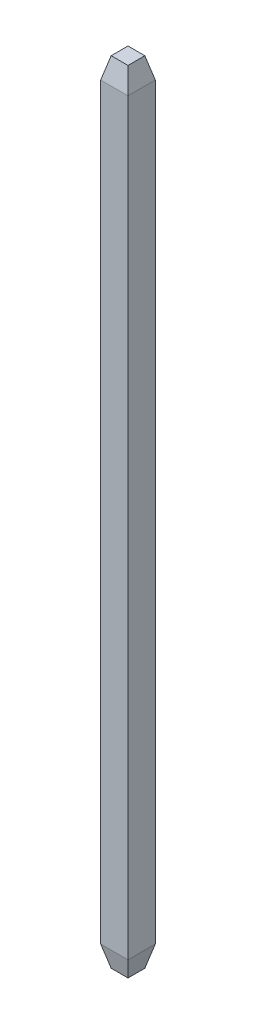
ISO-10303-21;
HEADER;
FILE_DESCRIPTION(('STEP AP214'),'2;1');
FILE_NAME('part.step','',(''),(''),'','','');
FILE_SCHEMA(('AUTOMOTIVE_DESIGN { 1 0 10303 214 1 1 1 1 }'));
ENDSEC;
DATA;
#1=APPLICATION_CONTEXT('core data for automotive mechanical design processes');
#2=APPLICATION_PROTOCOL_DEFINITION('international standard','automotive_design',2000,#1);
#3=PRODUCT_CONTEXT('',#1,'mechanical');
#4=PRODUCT('Part','Part','',(#3));
#5=PRODUCT_RELATED_PRODUCT_CATEGORY('part','',(#4));
#6=PRODUCT_DEFINITION_FORMATION('','',#4);
#7=PRODUCT_DEFINITION_CONTEXT('part definition',#1,'design');
#8=PRODUCT_DEFINITION('design','',#6,#7);
#9=PRODUCT_DEFINITION_SHAPE('','',#8);
#10=(LENGTH_UNIT() NAMED_UNIT(*) SI_UNIT(.MILLI.,.METRE.));
#11=(NAMED_UNIT(*) PLANE_ANGLE_UNIT() SI_UNIT($,.RADIAN.));
#12=(NAMED_UNIT(*) SI_UNIT($,.STERADIAN.) SOLID_ANGLE_UNIT());
#13=UNCERTAINTY_MEASURE_WITH_UNIT(LENGTH_MEASURE(1.E-05),#10,'distance_accuracy_value','');
#14=(GEOMETRIC_REPRESENTATION_CONTEXT(3) GLOBAL_UNCERTAINTY_ASSIGNED_CONTEXT((#13)) GLOBAL_UNIT_ASSIGNED_CONTEXT((#10,
#11,#12)) REPRESENTATION_CONTEXT('',''));
#15=CARTESIAN_POINT('',(0.,0.,0.));
#16=DIRECTION('',(0.,0.,1.));
#17=DIRECTION('',(1.,0.,0.));
#18=AXIS2_PLACEMENT_3D('',#15,#16,#17);
#19=CARTESIAN_POINT('',(0.325,9.4,0.325));
#20=DIRECTION('',(-1.,0.,0.));
#21=DIRECTION('',(0.,0.,1.));
#22=AXIS2_PLACEMENT_3D('',#19,#20,#21);
#23=PLANE('',#22);
#24=CARTESIAN_POINT('',(0.325,-8.9,0.325));
#25=DIRECTION('',(0.,0.,-1.));
#26=VECTOR('',#25,1.);
#27=LINE('',#24,#26);
#28=CARTESIAN_POINT('',(0.325,-8.9,0.325));
#29=VERTEX_POINT('',#28);
#30=CARTESIAN_POINT('',(0.325,-8.9,-0.325));
#31=VERTEX_POINT('',#30);
#32=EDGE_CURVE('E72',#29,#31,#27,.T.);
#33=ORIENTED_EDGE('',*,*,#32,.T.);
#34=DIRECTION('',(0.,-1.,0.));
#35=VECTOR('',#34,1.);
#36=CARTESIAN_POINT('',(0.325,9.4,-0.325));
#37=LINE('',#36,#35);
#38=CARTESIAN_POINT('',(0.325,8.9,-0.325));
#39=VERTEX_POINT('',#38);
#40=EDGE_CURVE('E12',#39,#31,#37,.T.);
#41=ORIENTED_EDGE('',*,*,#40,.F.);
#42=CARTESIAN_POINT('',(0.325,8.9,0.325));
#43=DIRECTION('',(0.,0.,-1.));
#44=VECTOR('',#43,1.);
#45=LINE('',#42,#44);
#46=CARTESIAN_POINT('',(0.325,8.9,0.325));
#47=VERTEX_POINT('',#46);
#48=EDGE_CURVE('E219',#47,#39,#45,.T.);
#49=ORIENTED_EDGE('',*,*,#48,.F.);
#50=DIRECTION('',(0.,-1.,0.));
#51=VECTOR('',#50,1.);
#52=CARTESIAN_POINT('',(0.325,9.4,0.325));
#53=LINE('',#52,#51);
#54=EDGE_CURVE('E162',#47,#29,#53,.T.);
#55=ORIENTED_EDGE('',*,*,#54,.T.);
#56=EDGE_LOOP('',(#33,#41,#49,#55));
#57=FACE_BOUND('',#56,.T.);
#58=ADVANCED_FACE('F54',(#57),#23,.F.);
#59=CARTESIAN_POINT('',(-0.325,9.4,-0.325));
#60=DIRECTION('',(0.,0.,1.));
#61=DIRECTION('',(1.,0.,0.));
#62=AXIS2_PLACEMENT_3D('',#59,#60,#61);
#63=PLANE('',#62);
#64=CARTESIAN_POINT('',(0.325,-8.9,-0.325));
#65=DIRECTION('',(-1.,0.,0.));
#66=VECTOR('',#65,1.);
#67=LINE('',#64,#66);
#68=CARTESIAN_POINT('',(-0.325,-8.9,-0.325));
#69=VERTEX_POINT('',#68);
#70=EDGE_CURVE('E157',#31,#69,#67,.T.);
#71=ORIENTED_EDGE('',*,*,#70,.T.);
#72=DIRECTION('',(0.,-1.,0.));
#73=VECTOR('',#72,1.);
#74=CARTESIAN_POINT('',(-0.325,9.4,-0.325));
#75=LINE('',#74,#73);
#76=CARTESIAN_POINT('',(-0.325,8.9,-0.325));
#77=VERTEX_POINT('',#76);
#78=EDGE_CURVE('E64',#77,#69,#75,.T.);
#79=ORIENTED_EDGE('',*,*,#78,.F.);
#80=CARTESIAN_POINT('',(0.325,8.9,-0.325));
#81=DIRECTION('',(-1.,0.,0.));
#82=VECTOR('',#81,1.);
#83=LINE('',#80,#82);
#84=EDGE_CURVE('E165',#39,#77,#83,.T.);
#85=ORIENTED_EDGE('',*,*,#84,.F.);
#86=ORIENTED_EDGE('',*,*,#40,.T.);
#87=EDGE_LOOP('',(#71,#79,#85,#86));
#88=FACE_BOUND('',#87,.T.);
#89=ADVANCED_FACE('F187',(#88),#63,.F.);
#90=CARTESIAN_POINT('',(-0.325,9.4,0.325));
#91=DIRECTION('',(1.,0.,0.));
#92=DIRECTION('',(0.,0.,-1.));
#93=AXIS2_PLACEMENT_3D('',#90,#91,#92);
#94=PLANE('',#93);
#95=CARTESIAN_POINT('',(-0.325,-8.9,-0.325));
#96=DIRECTION('',(0.,0.,1.));
#97=VECTOR('',#96,1.);
#98=LINE('',#95,#97);
#99=CARTESIAN_POINT('',(-0.325,-8.9,0.325));
#100=VERTEX_POINT('',#99);
#101=EDGE_CURVE('E130',#69,#100,#98,.T.);
#102=ORIENTED_EDGE('',*,*,#101,.T.);
#103=DIRECTION('',(0.,-1.,0.));
#104=VECTOR('',#103,1.);
#105=CARTESIAN_POINT('',(-0.325,9.4,0.325));
#106=LINE('',#105,#104);
#107=CARTESIAN_POINT('',(-0.325,8.9,0.325));
#108=VERTEX_POINT('',#107);
#109=EDGE_CURVE('E155',#108,#100,#106,.T.);
#110=ORIENTED_EDGE('',*,*,#109,.F.);
#111=CARTESIAN_POINT('',(-0.325,8.9,-0.325));
#112=DIRECTION('',(0.,0.,1.));
#113=VECTOR('',#112,1.);
#114=LINE('',#111,#113);
#115=EDGE_CURVE('E175',#77,#108,#114,.T.);
#116=ORIENTED_EDGE('',*,*,#115,.F.);
#117=ORIENTED_EDGE('',*,*,#78,.T.);
#118=EDGE_LOOP('',(#102,#110,#116,#117));
#119=FACE_BOUND('',#118,.T.);
#120=ADVANCED_FACE('F153',(#119),#94,.F.);
#121=CARTESIAN_POINT('',(-0.325,9.4,0.325));
#122=DIRECTION('',(0.,0.,-1.));
#123=DIRECTION('',(-1.,0.,0.));
#124=AXIS2_PLACEMENT_3D('',#121,#122,#123);
#125=PLANE('',#124);
#126=CARTESIAN_POINT('',(-0.325,-8.9,0.325));
#127=DIRECTION('',(1.,0.,0.));
#128=VECTOR('',#127,1.);
#129=LINE('',#126,#128);
#130=EDGE_CURVE('E142',#100,#29,#129,.T.);
#131=ORIENTED_EDGE('',*,*,#130,.T.);
#132=ORIENTED_EDGE('',*,*,#54,.F.);
#133=CARTESIAN_POINT('',(-0.325,8.90000000000001,0.324999999999999));
#134=DIRECTION('',(1.,0.,0.));
#135=VECTOR('',#134,1.);
#136=LINE('',#133,#135);
#137=EDGE_CURVE('E81',#108,#47,#136,.T.);
#138=ORIENTED_EDGE('',*,*,#137,.F.);
#139=ORIENTED_EDGE('',*,*,#109,.T.);
#140=EDGE_LOOP('',(#131,#132,#138,#139));
#141=FACE_BOUND('',#140,.T.);
#142=ADVANCED_FACE('F161',(#141),#125,.F.);
#143=CARTESIAN_POINT('',(0.,9.4,0.));
#144=DIRECTION('',(0.,-1.,0.));
#145=DIRECTION('',(0.,0.,-1.));
#146=AXIS2_PLACEMENT_3D('',#143,#144,#145);
#147=PLANE('',#146);
#148=DIRECTION('',(0.,0.,-1.));
#149=VECTOR('',#148,1.);
#150=CARTESIAN_POINT('',(0.2,9.4,0.2));
#151=LINE('',#150,#149);
#152=CARTESIAN_POINT('',(0.2,9.4,0.2));
#153=VERTEX_POINT('',#152);
#154=CARTESIAN_POINT('',(0.2,9.4,-0.2));
#155=VERTEX_POINT('',#154);
#156=EDGE_CURVE('E252',#153,#155,#151,.T.);
#157=ORIENTED_EDGE('',*,*,#156,.T.);
#158=DIRECTION('',(-1.,0.,0.));
#159=VECTOR('',#158,1.);
#160=CARTESIAN_POINT('',(-0.2,9.4,-0.2));
#161=LINE('',#160,#159);
#162=CARTESIAN_POINT('',(-0.2,9.4,-0.2));
#163=VERTEX_POINT('',#162);
#164=EDGE_CURVE('E308',#155,#163,#161,.T.);
#165=ORIENTED_EDGE('',*,*,#164,.T.);
#166=DIRECTION('',(0.,0.,1.));
#167=VECTOR('',#166,1.);
#168=CARTESIAN_POINT('',(-0.2,9.4,0.2));
#169=LINE('',#168,#167);
#170=CARTESIAN_POINT('',(-0.2,9.4,0.2));
#171=VERTEX_POINT('',#170);
#172=EDGE_CURVE('E320',#163,#171,#169,.T.);
#173=ORIENTED_EDGE('',*,*,#172,.T.);
#174=DIRECTION('',(1.,0.,0.));
#175=VECTOR('',#174,1.);
#176=CARTESIAN_POINT('',(-0.2,9.4,0.2));
#177=LINE('',#176,#175);
#178=EDGE_CURVE('E383',#171,#153,#177,.T.);
#179=ORIENTED_EDGE('',*,*,#178,.T.);
#180=EDGE_LOOP('',(#157,#165,#173,#179));
#181=FACE_BOUND('',#180,.T.);
#182=ADVANCED_FACE('F334',(#181),#147,.F.);
#183=CARTESIAN_POINT('',(-2.4,0.599999999999999,0.));
#184=DIRECTION('',(0.970142500145332,-0.242535625036333,0.));
#185=DIRECTION('',(0.242535625036333,0.970142500145332,0.));
#186=AXIS2_PLACEMENT_3D('',#183,#184,#185);
#187=PLANE('',#186);
#188=DIRECTION('',(0.235702260395516,0.942809041582063,-0.235702260395516));
#189=VECTOR('',#188,1.);
#190=CARTESIAN_POINT('',(-0.325,8.9,0.325));
#191=LINE('',#190,#189);
#192=EDGE_CURVE('E148',#108,#171,#191,.T.);
#193=ORIENTED_EDGE('',*,*,#192,.T.);
#194=ORIENTED_EDGE('',*,*,#172,.F.);
#195=DIRECTION('',(0.235702260395516,0.942809041582063,0.235702260395516));
#196=VECTOR('',#195,1.);
#197=CARTESIAN_POINT('',(-0.325,8.9,-0.325));
#198=LINE('',#197,#196);
#199=EDGE_CURVE('E257',#77,#163,#198,.T.);
#200=ORIENTED_EDGE('',*,*,#199,.F.);
#201=ORIENTED_EDGE('',*,*,#115,.T.);
#202=EDGE_LOOP('',(#193,#194,#200,#201));
#203=FACE_BOUND('',#202,.T.);
#204=ADVANCED_FACE('F326',(#203),#187,.F.);
#205=CARTESIAN_POINT('',(0.,0.599999999999999,-2.4));
#206=DIRECTION('',(0.,-0.242535625036333,0.970142500145332));
#207=DIRECTION('',(0.,-0.970142500145332,-0.242535625036333));
#208=AXIS2_PLACEMENT_3D('',#205,#206,#207);
#209=PLANE('',#208);
#210=ORIENTED_EDGE('',*,*,#199,.T.);
#211=ORIENTED_EDGE('',*,*,#164,.F.);
#212=DIRECTION('',(-0.235702260395516,0.942809041582063,0.235702260395516));
#213=VECTOR('',#212,1.);
#214=CARTESIAN_POINT('',(0.325,8.9,-0.325));
#215=LINE('',#214,#213);
#216=EDGE_CURVE('E256',#39,#155,#215,.T.);
#217=ORIENTED_EDGE('',*,*,#216,.F.);
#218=ORIENTED_EDGE('',*,*,#84,.T.);
#219=EDGE_LOOP('',(#210,#211,#217,#218));
#220=FACE_BOUND('',#219,.T.);
#221=ADVANCED_FACE('F282',(#220),#209,.F.);
#222=CARTESIAN_POINT('',(0.,0.599999999999999,2.4));
#223=DIRECTION('',(0.,-0.242535625036333,-0.970142500145332));
#224=DIRECTION('',(0.,0.970142500145332,-0.242535625036333));
#225=AXIS2_PLACEMENT_3D('',#222,#223,#224);
#226=PLANE('',#225);
#227=DIRECTION('',(-0.235702260395516,0.942809041582063,-0.235702260395516));
#228=VECTOR('',#227,1.);
#229=CARTESIAN_POINT('',(0.325,8.9,0.325));
#230=LINE('',#229,#228);
#231=EDGE_CURVE('E249',#47,#153,#230,.T.);
#232=ORIENTED_EDGE('',*,*,#231,.T.);
#233=ORIENTED_EDGE('',*,*,#178,.F.);
#234=ORIENTED_EDGE('',*,*,#192,.F.);
#235=ORIENTED_EDGE('',*,*,#137,.T.);
#236=EDGE_LOOP('',(#232,#233,#234,#235));
#237=FACE_BOUND('',#236,.T.);
#238=ADVANCED_FACE('F261',(#237),#226,.F.);
#239=CARTESIAN_POINT('',(2.4,0.599999999999999,0.));
#240=DIRECTION('',(-0.970142500145332,-0.242535625036333,0.));
#241=DIRECTION('',(0.242535625036333,-0.970142500145332,0.));
#242=AXIS2_PLACEMENT_3D('',#239,#240,#241);
#243=PLANE('',#242);
#244=ORIENTED_EDGE('',*,*,#216,.T.);
#245=ORIENTED_EDGE('',*,*,#156,.F.);
#246=ORIENTED_EDGE('',*,*,#231,.F.);
#247=ORIENTED_EDGE('',*,*,#48,.T.);
#248=EDGE_LOOP('',(#244,#245,#246,#247));
#249=FACE_BOUND('',#248,.T.);
#250=ADVANCED_FACE('F250',(#249),#243,.F.);
#251=CARTESIAN_POINT('',(0.,-9.4,0.));
#252=DIRECTION('',(0.,1.,0.));
#253=DIRECTION('',(0.,0.,-1.));
#254=AXIS2_PLACEMENT_3D('',#251,#252,#253);
#255=PLANE('',#254);
#256=DIRECTION('',(0.,0.,-1.));
#257=VECTOR('',#256,1.);
#258=CARTESIAN_POINT('',(0.2,-9.4,0.2));
#259=LINE('',#258,#257);
#260=CARTESIAN_POINT('',(0.2,-9.4,0.2));
#261=VERTEX_POINT('',#260);
#262=CARTESIAN_POINT('',(0.2,-9.4,-0.2));
#263=VERTEX_POINT('',#262);
#264=EDGE_CURVE('E550',#261,#263,#259,.T.);
#265=ORIENTED_EDGE('',*,*,#264,.F.);
#266=DIRECTION('',(1.,0.,0.));
#267=VECTOR('',#266,1.);
#268=CARTESIAN_POINT('',(-0.2,-9.4,0.2));
#269=LINE('',#268,#267);
#270=CARTESIAN_POINT('',(-0.2,-9.4,0.2));
#271=VERTEX_POINT('',#270);
#272=EDGE_CURVE('E158',#271,#261,#269,.T.);
#273=ORIENTED_EDGE('',*,*,#272,.F.);
#274=DIRECTION('',(0.,0.,1.));
#275=VECTOR('',#274,1.);
#276=CARTESIAN_POINT('',(-0.2,-9.4,0.2));
#277=LINE('',#276,#275);
#278=CARTESIAN_POINT('',(-0.2,-9.4,-0.2));
#279=VERTEX_POINT('',#278);
#280=EDGE_CURVE('E134',#279,#271,#277,.T.);
#281=ORIENTED_EDGE('',*,*,#280,.F.);
#282=DIRECTION('',(-1.,0.,0.));
#283=VECTOR('',#282,1.);
#284=CARTESIAN_POINT('',(-0.2,-9.4,-0.2));
#285=LINE('',#284,#283);
#286=EDGE_CURVE('E506',#263,#279,#285,.T.);
#287=ORIENTED_EDGE('',*,*,#286,.F.);
#288=EDGE_LOOP('',(#265,#273,#281,#287));
#289=FACE_BOUND('',#288,.T.);
#290=ADVANCED_FACE('F335',(#289),#255,.F.);
#291=CARTESIAN_POINT('',(-2.4,-0.599999999999999,0.));
#292=DIRECTION('',(0.970142500145332,0.242535625036333,0.));
#293=DIRECTION('',(0.242535625036333,-0.970142500145332,0.));
#294=AXIS2_PLACEMENT_3D('',#291,#292,#293);
#295=PLANE('',#294);
#296=DIRECTION('',(0.235702260395516,-0.942809041582063,-0.235702260395516));
#297=VECTOR('',#296,1.);
#298=CARTESIAN_POINT('',(-0.325,-8.9,0.325));
#299=LINE('',#298,#297);
#300=EDGE_CURVE('E126',#100,#271,#299,.T.);
#301=ORIENTED_EDGE('',*,*,#300,.F.);
#302=ORIENTED_EDGE('',*,*,#101,.F.);
#303=DIRECTION('',(0.235702260395516,-0.942809041582063,0.235702260395516));
#304=VECTOR('',#303,1.);
#305=CARTESIAN_POINT('',(-0.325,-8.9,-0.325));
#306=LINE('',#305,#304);
#307=EDGE_CURVE('E139',#69,#279,#306,.T.);
#308=ORIENTED_EDGE('',*,*,#307,.T.);
#309=ORIENTED_EDGE('',*,*,#280,.T.);
#310=EDGE_LOOP('',(#301,#302,#308,#309));
#311=FACE_BOUND('',#310,.T.);
#312=ADVANCED_FACE('F128',(#311),#295,.F.);
#313=CARTESIAN_POINT('',(0.,-0.599999999999999,-2.4));
#314=DIRECTION('',(0.,0.242535625036333,0.970142500145332));
#315=DIRECTION('',(0.,0.970142500145332,-0.242535625036333));
#316=AXIS2_PLACEMENT_3D('',#313,#314,#315);
#317=PLANE('',#316);
#318=ORIENTED_EDGE('',*,*,#307,.F.);
#319=ORIENTED_EDGE('',*,*,#70,.F.);
#320=DIRECTION('',(-0.235702260395516,-0.942809041582063,0.235702260395516));
#321=VECTOR('',#320,1.);
#322=CARTESIAN_POINT('',(0.325,-8.9,-0.325));
#323=LINE('',#322,#321);
#324=EDGE_CURVE('E552',#31,#263,#323,.T.);
#325=ORIENTED_EDGE('',*,*,#324,.T.);
#326=ORIENTED_EDGE('',*,*,#286,.T.);
#327=EDGE_LOOP('',(#318,#319,#325,#326));
#328=FACE_BOUND('',#327,.T.);
#329=ADVANCED_FACE('F455',(#328),#317,.F.);
#330=CARTESIAN_POINT('',(0.,-0.599999999999999,2.4));
#331=DIRECTION('',(0.,0.242535625036333,-0.970142500145332));
#332=DIRECTION('',(0.,-0.970142500145332,-0.242535625036333));
#333=AXIS2_PLACEMENT_3D('',#330,#331,#332);
#334=PLANE('',#333);
#335=DIRECTION('',(-0.235702260395516,-0.942809041582063,-0.235702260395516));
#336=VECTOR('',#335,1.);
#337=CARTESIAN_POINT('',(0.325,-8.9,0.325));
#338=LINE('',#337,#336);
#339=EDGE_CURVE('E145',#29,#261,#338,.T.);
#340=ORIENTED_EDGE('',*,*,#339,.F.);
#341=ORIENTED_EDGE('',*,*,#130,.F.);
#342=ORIENTED_EDGE('',*,*,#300,.T.);
#343=ORIENTED_EDGE('',*,*,#272,.T.);
#344=EDGE_LOOP('',(#340,#341,#342,#343));
#345=FACE_BOUND('',#344,.T.);
#346=ADVANCED_FACE('F144',(#345),#334,.F.);
#347=CARTESIAN_POINT('',(2.4,-0.599999999999999,0.));
#348=DIRECTION('',(-0.970142500145332,0.242535625036333,0.));
#349=DIRECTION('',(0.242535625036333,0.970142500145332,0.));
#350=AXIS2_PLACEMENT_3D('',#347,#348,#349);
#351=PLANE('',#350);
#352=ORIENTED_EDGE('',*,*,#324,.F.);
#353=ORIENTED_EDGE('',*,*,#32,.F.);
#354=ORIENTED_EDGE('',*,*,#339,.T.);
#355=ORIENTED_EDGE('',*,*,#264,.T.);
#356=EDGE_LOOP('',(#352,#353,#354,#355));
#357=FACE_BOUND('',#356,.T.);
#358=ADVANCED_FACE('F473',(#357),#351,.F.);
#359=CLOSED_SHELL('',(#58,#89,#120,#142,#182,#204,#221,#238,#250,#290,#312,#329,#346,#358));
#360=MANIFOLD_SOLID_BREP('B2',#359);
#361=ADVANCED_BREP_SHAPE_REPRESENTATION('',(#18,#360),#14);
#362=SHAPE_DEFINITION_REPRESENTATION(#9,#361);
ENDSEC;
END-ISO-10303-21;
